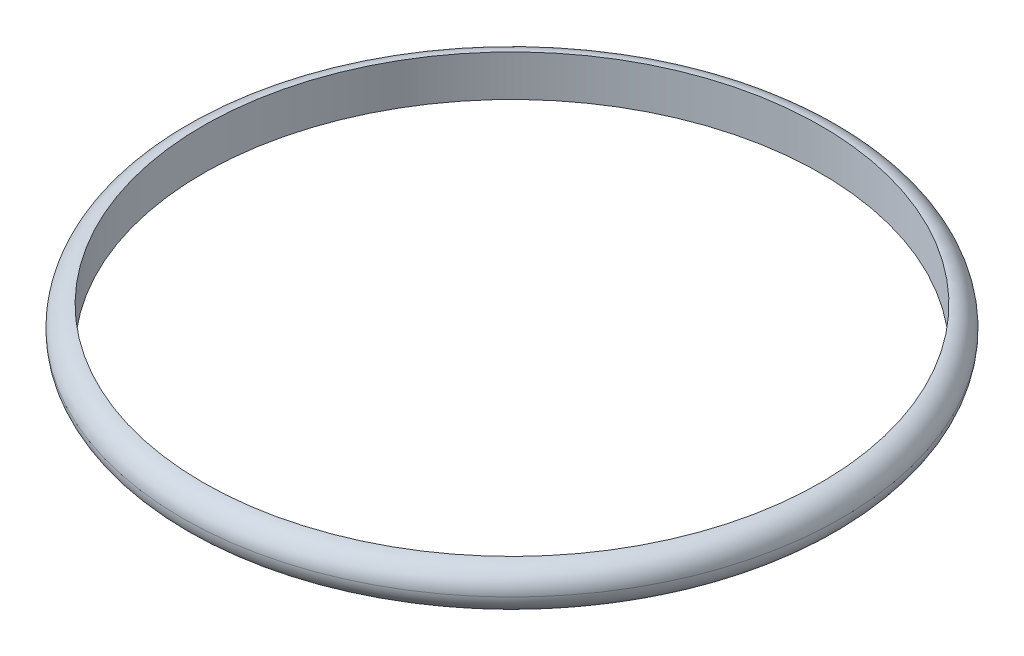
ISO-10303-21;
HEADER;
FILE_DESCRIPTION(('STEP AP214'),'2;1');
FILE_NAME('part.step','',(''),(''),'','','');
FILE_SCHEMA(('AUTOMOTIVE_DESIGN { 1 0 10303 214 1 1 1 1 }'));
ENDSEC;
DATA;
#1=APPLICATION_CONTEXT('core data for automotive mechanical design processes');
#2=APPLICATION_PROTOCOL_DEFINITION('international standard','automotive_design',2000,#1);
#3=PRODUCT_CONTEXT('',#1,'mechanical');
#4=PRODUCT('Part','Part','',(#3));
#5=PRODUCT_RELATED_PRODUCT_CATEGORY('part','',(#4));
#6=PRODUCT_DEFINITION_FORMATION('','',#4);
#7=PRODUCT_DEFINITION_CONTEXT('part definition',#1,'design');
#8=PRODUCT_DEFINITION('design','',#6,#7);
#9=PRODUCT_DEFINITION_SHAPE('','',#8);
#10=(LENGTH_UNIT() NAMED_UNIT(*) SI_UNIT(.MILLI.,.METRE.));
#11=(NAMED_UNIT(*) PLANE_ANGLE_UNIT() SI_UNIT($,.RADIAN.));
#12=(NAMED_UNIT(*) SI_UNIT($,.STERADIAN.) SOLID_ANGLE_UNIT());
#13=UNCERTAINTY_MEASURE_WITH_UNIT(LENGTH_MEASURE(1.E-05),#10,'distance_accuracy_value','');
#14=(GEOMETRIC_REPRESENTATION_CONTEXT(3) GLOBAL_UNCERTAINTY_ASSIGNED_CONTEXT((#13)) GLOBAL_UNIT_ASSIGNED_CONTEXT((#10,
#11,#12)) REPRESENTATION_CONTEXT('',''));
#15=CARTESIAN_POINT('',(0.,0.,0.));
#16=DIRECTION('',(0.,0.,1.));
#17=DIRECTION('',(1.,0.,0.));
#18=AXIS2_PLACEMENT_3D('',#15,#16,#17);
#19=CARTESIAN_POINT('',(0.,4.,0.));
#20=DIRECTION('',(0.,-1.,0.));
#21=DIRECTION('',(0.,0.,-1.));
#22=AXIS2_PLACEMENT_3D('',#19,#20,#21);
#23=CYLINDRICAL_SURFACE('',#22,30.);
#24=CARTESIAN_POINT('',(0.,4.,0.));
#25=DIRECTION('',(0.,1.,0.));
#26=DIRECTION('',(0.,0.,1.));
#27=AXIS2_PLACEMENT_3D('',#24,#25,#26);
#28=CIRCLE('',#27,30.);
#29=CARTESIAN_POINT('',(0.,4.,30.));
#30=VERTEX_POINT('',#29);
#31=EDGE_CURVE('E10',#30,#30,#28,.T.);
#32=ORIENTED_EDGE('',*,*,#31,.T.);
#33=EDGE_LOOP('',(#32));
#34=FACE_BOUND('',#33,.T.);
#35=CARTESIAN_POINT('',(0.,0.,0.));
#36=DIRECTION('',(0.,1.,0.));
#37=DIRECTION('',(0.,0.,1.));
#38=AXIS2_PLACEMENT_3D('',#35,#36,#37);
#39=CIRCLE('',#38,30.);
#40=CARTESIAN_POINT('',(0.,0.,30.));
#41=VERTEX_POINT('',#40);
#42=EDGE_CURVE('E36',#41,#41,#39,.T.);
#43=ORIENTED_EDGE('',*,*,#42,.F.);
#44=EDGE_LOOP('',(#43));
#45=FACE_BOUND('',#44,.T.);
#46=ADVANCED_FACE('F28',(#34,#45),#23,.F.);
#47=CARTESIAN_POINT('',(0.,2.,0.));
#48=DIRECTION('',(0.,1.,0.));
#49=DIRECTION('',(0.,0.,1.));
#50=AXIS2_PLACEMENT_3D('',#47,#48,#49);
#51=TOROIDAL_SURFACE('',#50,30.,2.);
#52=ORIENTED_EDGE('',*,*,#31,.F.);
#53=EDGE_LOOP('',(#52));
#54=FACE_BOUND('',#53,.T.);
#55=CARTESIAN_POINT('',(0.,2.,0.));
#56=DIRECTION('',(0.,1.,0.));
#57=DIRECTION('',(0.,0.,1.));
#58=AXIS2_PLACEMENT_3D('',#55,#56,#57);
#59=CIRCLE('',#58,32.);
#60=CARTESIAN_POINT('',(0.,2.,32.));
#61=VERTEX_POINT('',#60);
#62=EDGE_CURVE('E32',#61,#61,#59,.F.);
#63=ORIENTED_EDGE('',*,*,#62,.F.);
#64=EDGE_LOOP('',(#63));
#65=FACE_BOUND('',#64,.T.);
#66=ADVANCED_FACE('F30',(#54,#65),#51,.T.);
#67=CARTESIAN_POINT('',(0.,2.,0.));
#68=DIRECTION('',(0.,1.,0.));
#69=DIRECTION('',(0.,0.,1.));
#70=AXIS2_PLACEMENT_3D('',#67,#68,#69);
#71=TOROIDAL_SURFACE('',#70,30.,2.);
#72=ORIENTED_EDGE('',*,*,#42,.T.);
#73=EDGE_LOOP('',(#72));
#74=FACE_BOUND('',#73,.T.);
#75=ORIENTED_EDGE('',*,*,#62,.T.);
#76=EDGE_LOOP('',(#75));
#77=FACE_BOUND('',#76,.T.);
#78=ADVANCED_FACE('F46',(#74,#77),#71,.T.);
#79=CLOSED_SHELL('',(#46,#66,#78));
#80=MANIFOLD_SOLID_BREP('B2',#79);
#81=ADVANCED_BREP_SHAPE_REPRESENTATION('',(#18,#80),#14);
#82=SHAPE_DEFINITION_REPRESENTATION(#9,#81);
ENDSEC;
END-ISO-10303-21;
